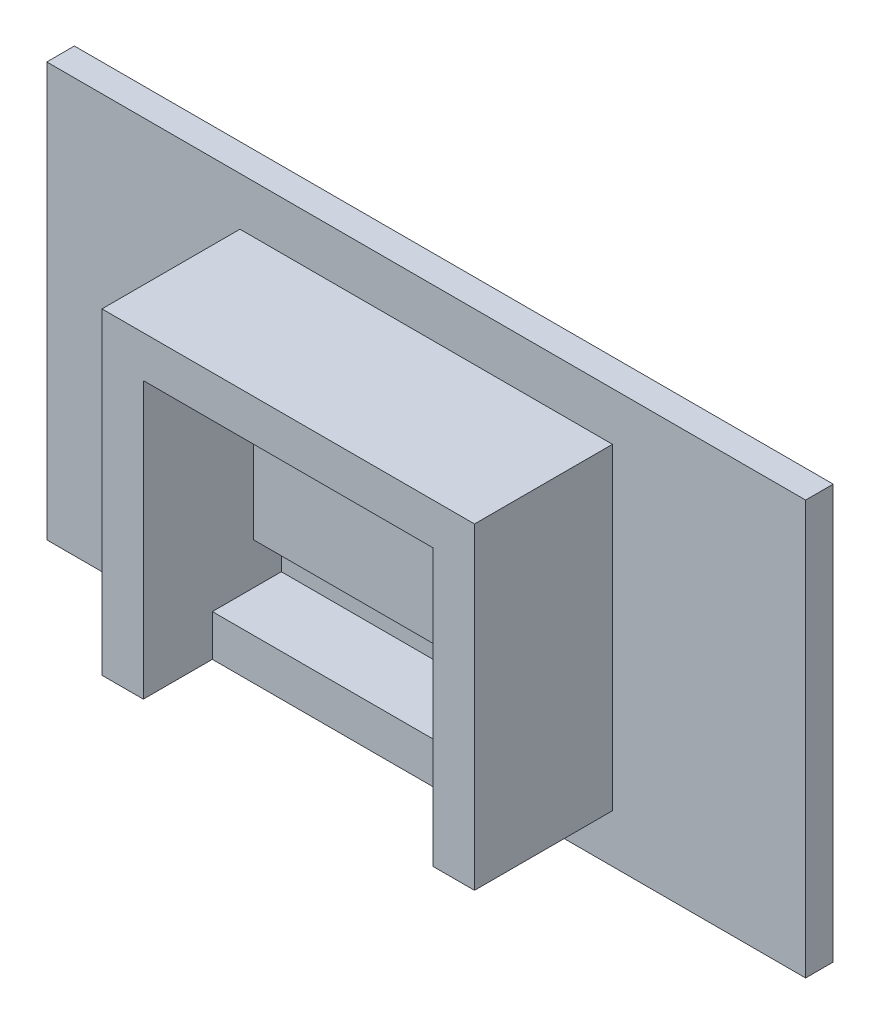
ISO-10303-21;
HEADER;
FILE_DESCRIPTION(('STEP AP214'),'2;1');
FILE_NAME('part.step','',(''),(''),'','','');
FILE_SCHEMA(('AUTOMOTIVE_DESIGN { 1 0 10303 214 1 1 1 1 }'));
ENDSEC;
DATA;
#1=APPLICATION_CONTEXT('core data for automotive mechanical design processes');
#2=APPLICATION_PROTOCOL_DEFINITION('international standard','automotive_design',2000,#1);
#3=PRODUCT_CONTEXT('',#1,'mechanical');
#4=PRODUCT('Part','Part','',(#3));
#5=PRODUCT_RELATED_PRODUCT_CATEGORY('part','',(#4));
#6=PRODUCT_DEFINITION_FORMATION('','',#4);
#7=PRODUCT_DEFINITION_CONTEXT('part definition',#1,'design');
#8=PRODUCT_DEFINITION('design','',#6,#7);
#9=PRODUCT_DEFINITION_SHAPE('','',#8);
#10=(LENGTH_UNIT() NAMED_UNIT(*) SI_UNIT(.MILLI.,.METRE.));
#11=(NAMED_UNIT(*) PLANE_ANGLE_UNIT() SI_UNIT($,.RADIAN.));
#12=(NAMED_UNIT(*) SI_UNIT($,.STERADIAN.) SOLID_ANGLE_UNIT());
#13=UNCERTAINTY_MEASURE_WITH_UNIT(LENGTH_MEASURE(1.E-05),#10,'distance_accuracy_value','');
#14=(GEOMETRIC_REPRESENTATION_CONTEXT(3) GLOBAL_UNCERTAINTY_ASSIGNED_CONTEXT((#13)) GLOBAL_UNIT_ASSIGNED_CONTEXT((#10,
#11,#12)) REPRESENTATION_CONTEXT('',''));
#15=CARTESIAN_POINT('',(0.,0.,0.));
#16=DIRECTION('',(0.,0.,1.));
#17=DIRECTION('',(1.,0.,0.));
#18=AXIS2_PLACEMENT_3D('',#15,#16,#17);
#19=CARTESIAN_POINT('',(-10.5,8.5,12.));
#20=DIRECTION('',(1.,0.,0.));
#21=DIRECTION('',(0.,1.,0.));
#22=AXIS2_PLACEMENT_3D('',#19,#20,#21);
#23=PLANE('',#22);
#24=DIRECTION('',(0.,-1.,0.));
#25=VECTOR('',#24,1.);
#26=CARTESIAN_POINT('',(-10.5,8.5,2.));
#27=LINE('',#26,#25);
#28=CARTESIAN_POINT('',(-10.5,-5.5,2.));
#29=VERTEX_POINT('',#28);
#30=CARTESIAN_POINT('',(-10.5,-8.5,2.));
#31=VERTEX_POINT('',#30);
#32=EDGE_CURVE('E554',#29,#31,#27,.T.);
#33=ORIENTED_EDGE('',*,*,#32,.F.);
#34=DIRECTION('',(0.,0.,-1.));
#35=VECTOR('',#34,1.);
#36=CARTESIAN_POINT('',(-10.5,-5.5,4.));
#37=LINE('',#36,#35);
#38=CARTESIAN_POINT('',(-10.5,-5.5,4.));
#39=VERTEX_POINT('',#38);
#40=EDGE_CURVE('E63',#39,#29,#37,.T.);
#41=ORIENTED_EDGE('',*,*,#40,.F.);
#42=DIRECTION('',(0.,-1.,0.));
#43=VECTOR('',#42,1.);
#44=CARTESIAN_POINT('',(-10.5,8.5,4.));
#45=LINE('',#44,#43);
#46=CARTESIAN_POINT('',(-10.5,8.5,4.));
#47=VERTEX_POINT('',#46);
#48=EDGE_CURVE('E529',#47,#39,#45,.T.);
#49=ORIENTED_EDGE('',*,*,#48,.F.);
#50=DIRECTION('',(0.,0.,-1.));
#51=VECTOR('',#50,1.);
#52=CARTESIAN_POINT('',(-10.5,8.5,12.));
#53=LINE('',#52,#51);
#54=CARTESIAN_POINT('',(-10.5,8.5,12.));
#55=VERTEX_POINT('',#54);
#56=EDGE_CURVE('E566',#55,#47,#53,.T.);
#57=ORIENTED_EDGE('',*,*,#56,.F.);
#58=DIRECTION('',(0.,-1.,0.));
#59=VECTOR('',#58,1.);
#60=CARTESIAN_POINT('',(-10.5,8.5,12.));
#61=LINE('',#60,#59);
#62=CARTESIAN_POINT('',(-10.5,-11.5,12.));
#63=VERTEX_POINT('',#62);
#64=EDGE_CURVE('E555',#55,#63,#61,.T.);
#65=ORIENTED_EDGE('',*,*,#64,.T.);
#66=DIRECTION('',(0.,0.,-1.));
#67=VECTOR('',#66,1.);
#68=CARTESIAN_POINT('',(-10.5,-11.5,12.));
#69=LINE('',#68,#67);
#70=CARTESIAN_POINT('',(-10.5,-11.5,7.));
#71=VERTEX_POINT('',#70);
#72=EDGE_CURVE('E158',#63,#71,#69,.T.);
#73=ORIENTED_EDGE('',*,*,#72,.T.);
#74=DIRECTION('',(0.,-1.,0.));
#75=VECTOR('',#74,1.);
#76=CARTESIAN_POINT('',(-10.5,-8.5,7.));
#77=LINE('',#76,#75);
#78=CARTESIAN_POINT('',(-10.5,-8.5,7.));
#79=VERTEX_POINT('',#78);
#80=EDGE_CURVE('E153',#79,#71,#77,.T.);
#81=ORIENTED_EDGE('',*,*,#80,.F.);
#82=DIRECTION('',(0.,0.,-1.));
#83=VECTOR('',#82,1.);
#84=CARTESIAN_POINT('',(-10.5,-8.5,12.));
#85=LINE('',#84,#83);
#86=EDGE_CURVE('E155',#79,#31,#85,.T.);
#87=ORIENTED_EDGE('',*,*,#86,.T.);
#88=EDGE_LOOP('',(#33,#41,#49,#57,#65,#73,#81,#87));
#89=FACE_BOUND('',#88,.T.);
#90=ADVANCED_FACE('F39',(#89),#23,.T.);
#91=CARTESIAN_POINT('',(10.5,8.5,12.));
#92=DIRECTION('',(-1.,0.,0.));
#93=DIRECTION('',(0.,-1.,0.));
#94=AXIS2_PLACEMENT_3D('',#91,#92,#93);
#95=PLANE('',#94);
#96=DIRECTION('',(0.,1.,0.));
#97=VECTOR('',#96,1.);
#98=CARTESIAN_POINT('',(10.5,8.5,4.));
#99=LINE('',#98,#97);
#100=CARTESIAN_POINT('',(10.5,-5.5,4.));
#101=VERTEX_POINT('',#100);
#102=CARTESIAN_POINT('',(10.5,8.5,4.));
#103=VERTEX_POINT('',#102);
#104=EDGE_CURVE('E537',#101,#103,#99,.T.);
#105=ORIENTED_EDGE('',*,*,#104,.F.);
#106=DIRECTION('',(0.,0.,-1.));
#107=VECTOR('',#106,1.);
#108=CARTESIAN_POINT('',(10.5,-5.5,4.));
#109=LINE('',#108,#107);
#110=CARTESIAN_POINT('',(10.5,-5.5,2.));
#111=VERTEX_POINT('',#110);
#112=EDGE_CURVE('E545',#101,#111,#109,.T.);
#113=ORIENTED_EDGE('',*,*,#112,.T.);
#114=DIRECTION('',(0.,1.,0.));
#115=VECTOR('',#114,1.);
#116=CARTESIAN_POINT('',(10.5,8.5,2.));
#117=LINE('',#116,#115);
#118=CARTESIAN_POINT('',(10.5,-8.5,2.));
#119=VERTEX_POINT('',#118);
#120=EDGE_CURVE('E559',#119,#111,#117,.T.);
#121=ORIENTED_EDGE('',*,*,#120,.F.);
#122=DIRECTION('',(0.,0.,-1.));
#123=VECTOR('',#122,1.);
#124=CARTESIAN_POINT('',(10.5,-8.5,12.));
#125=LINE('',#124,#123);
#126=CARTESIAN_POINT('',(10.5,-8.5,7.));
#127=VERTEX_POINT('',#126);
#128=EDGE_CURVE('E175',#127,#119,#125,.T.);
#129=ORIENTED_EDGE('',*,*,#128,.F.);
#130=DIRECTION('',(0.,-1.,0.));
#131=VECTOR('',#130,1.);
#132=CARTESIAN_POINT('',(10.5,-8.5,7.));
#133=LINE('',#132,#131);
#134=CARTESIAN_POINT('',(10.5,-11.5,7.));
#135=VERTEX_POINT('',#134);
#136=EDGE_CURVE('E55',#127,#135,#133,.T.);
#137=ORIENTED_EDGE('',*,*,#136,.T.);
#138=DIRECTION('',(0.,0.,1.));
#139=VECTOR('',#138,1.);
#140=CARTESIAN_POINT('',(10.5,-11.5,12.));
#141=LINE('',#140,#139);
#142=CARTESIAN_POINT('',(10.5,-11.5,12.));
#143=VERTEX_POINT('',#142);
#144=EDGE_CURVE('E167',#135,#143,#141,.T.);
#145=ORIENTED_EDGE('',*,*,#144,.T.);
#146=DIRECTION('',(0.,1.,0.));
#147=VECTOR('',#146,1.);
#148=CARTESIAN_POINT('',(10.5,8.5,12.));
#149=LINE('',#148,#147);
#150=CARTESIAN_POINT('',(10.5,8.5,12.));
#151=VERTEX_POINT('',#150);
#152=EDGE_CURVE('E558',#143,#151,#149,.T.);
#153=ORIENTED_EDGE('',*,*,#152,.T.);
#154=DIRECTION('',(0.,0.,-1.));
#155=VECTOR('',#154,1.);
#156=CARTESIAN_POINT('',(10.5,8.5,12.));
#157=LINE('',#156,#155);
#158=EDGE_CURVE('E182',#151,#103,#157,.T.);
#159=ORIENTED_EDGE('',*,*,#158,.T.);
#160=EDGE_LOOP('',(#105,#113,#121,#129,#137,#145,#153,#159));
#161=FACE_BOUND('',#160,.T.);
#162=ADVANCED_FACE('F292',(#161),#95,.T.);
#163=CARTESIAN_POINT('',(0.,0.,2.));
#164=DIRECTION('',(0.,0.,-1.));
#165=DIRECTION('',(-1.,0.,0.));
#166=AXIS2_PLACEMENT_3D('',#163,#164,#165);
#167=PLANE('',#166);
#168=DIRECTION('',(1.,0.,0.));
#169=VECTOR('',#168,1.);
#170=CARTESIAN_POINT('',(-10.5,-5.5,2.));
#171=LINE('',#170,#169);
#172=EDGE_CURVE('E527',#29,#111,#171,.T.);
#173=ORIENTED_EDGE('',*,*,#172,.F.);
#174=ORIENTED_EDGE('',*,*,#32,.T.);
#175=DIRECTION('',(1.,0.,0.));
#176=VECTOR('',#175,1.);
#177=CARTESIAN_POINT('',(-10.5,-8.5,2.));
#178=LINE('',#177,#176);
#179=EDGE_CURVE('E172',#31,#119,#178,.T.);
#180=ORIENTED_EDGE('',*,*,#179,.T.);
#181=ORIENTED_EDGE('',*,*,#120,.T.);
#182=EDGE_LOOP('',(#173,#174,#180,#181));
#183=FACE_BOUND('',#182,.T.);
#184=ADVANCED_FACE('F297',(#183),#167,.F.);
#185=DIRECTION('',(0.,1.,0.));
#186=VECTOR('',#185,1.);
#187=CARTESIAN_POINT('',(27.5,-15.,2.));
#188=LINE('',#187,#186);
#189=CARTESIAN_POINT('',(27.5,-15.,2.));
#190=VERTEX_POINT('',#189);
#191=CARTESIAN_POINT('',(27.5,15.,2.));
#192=VERTEX_POINT('',#191);
#193=EDGE_CURVE('E229',#190,#192,#188,.T.);
#194=ORIENTED_EDGE('',*,*,#193,.T.);
#195=DIRECTION('',(-1.,0.,0.));
#196=VECTOR('',#195,1.);
#197=CARTESIAN_POINT('',(-27.5,15.,2.));
#198=LINE('',#197,#196);
#199=CARTESIAN_POINT('',(-27.5,15.,2.));
#200=VERTEX_POINT('',#199);
#201=EDGE_CURVE('E233',#192,#200,#198,.T.);
#202=ORIENTED_EDGE('',*,*,#201,.T.);
#203=DIRECTION('',(0.,-1.,0.));
#204=VECTOR('',#203,1.);
#205=CARTESIAN_POINT('',(-27.5,-15.,2.));
#206=LINE('',#205,#204);
#207=CARTESIAN_POINT('',(-27.5,-15.,2.));
#208=VERTEX_POINT('',#207);
#209=EDGE_CURVE('E237',#200,#208,#206,.T.);
#210=ORIENTED_EDGE('',*,*,#209,.T.);
#211=DIRECTION('',(1.,0.,0.));
#212=VECTOR('',#211,1.);
#213=CARTESIAN_POINT('',(-27.5,-15.,2.));
#214=LINE('',#213,#212);
#215=EDGE_CURVE('E240',#208,#190,#214,.T.);
#216=ORIENTED_EDGE('',*,*,#215,.T.);
#217=EDGE_LOOP('',(#194,#202,#210,#216));
#218=FACE_BOUND('',#217,.T.);
#219=DIRECTION('',(0.,1.,0.));
#220=VECTOR('',#219,1.);
#221=CARTESIAN_POINT('',(13.5,-11.5,2.));
#222=LINE('',#221,#220);
#223=CARTESIAN_POINT('',(13.5,-11.5,2.));
#224=VERTEX_POINT('',#223);
#225=CARTESIAN_POINT('',(13.5,11.5,2.));
#226=VERTEX_POINT('',#225);
#227=EDGE_CURVE('E174',#224,#226,#222,.T.);
#228=ORIENTED_EDGE('',*,*,#227,.F.);
#229=DIRECTION('',(1.,0.,0.));
#230=VECTOR('',#229,1.);
#231=CARTESIAN_POINT('',(-13.5,-11.5,2.));
#232=LINE('',#231,#230);
#233=CARTESIAN_POINT('',(-13.5,-11.5,2.));
#234=VERTEX_POINT('',#233);
#235=EDGE_CURVE('E191',#234,#224,#232,.T.);
#236=ORIENTED_EDGE('',*,*,#235,.F.);
#237=DIRECTION('',(0.,-1.,0.));
#238=VECTOR('',#237,1.);
#239=CARTESIAN_POINT('',(-13.5,-11.5,2.));
#240=LINE('',#239,#238);
#241=CARTESIAN_POINT('',(-13.5,11.5,2.));
#242=VERTEX_POINT('',#241);
#243=EDGE_CURVE('E206',#242,#234,#240,.T.);
#244=ORIENTED_EDGE('',*,*,#243,.F.);
#245=DIRECTION('',(-1.,0.,0.));
#246=VECTOR('',#245,1.);
#247=CARTESIAN_POINT('',(-13.5,11.5,2.));
#248=LINE('',#247,#246);
#249=EDGE_CURVE('E180',#226,#242,#248,.T.);
#250=ORIENTED_EDGE('',*,*,#249,.F.);
#251=EDGE_LOOP('',(#228,#236,#244,#250));
#252=FACE_BOUND('',#251,.T.);
#253=ADVANCED_FACE('F282',(#218,#252),#167,.F.);
#254=CARTESIAN_POINT('',(27.5,-15.,2.));
#255=DIRECTION('',(-1.,0.,0.));
#256=DIRECTION('',(0.,0.,1.));
#257=AXIS2_PLACEMENT_3D('',#254,#255,#256);
#258=PLANE('',#257);
#259=DIRECTION('',(0.,1.,0.));
#260=VECTOR('',#259,1.);
#261=CARTESIAN_POINT('',(27.5,-15.,0.));
#262=LINE('',#261,#260);
#263=CARTESIAN_POINT('',(27.5,-15.,0.));
#264=VERTEX_POINT('',#263);
#265=CARTESIAN_POINT('',(27.5,15.,0.));
#266=VERTEX_POINT('',#265);
#267=EDGE_CURVE('E228',#264,#266,#262,.T.);
#268=ORIENTED_EDGE('',*,*,#267,.T.);
#269=DIRECTION('',(0.,0.,-1.));
#270=VECTOR('',#269,1.);
#271=CARTESIAN_POINT('',(27.5,15.,2.));
#272=LINE('',#271,#270);
#273=EDGE_CURVE('E11',#192,#266,#272,.T.);
#274=ORIENTED_EDGE('',*,*,#273,.F.);
#275=ORIENTED_EDGE('',*,*,#193,.F.);
#276=DIRECTION('',(0.,0.,-1.));
#277=VECTOR('',#276,1.);
#278=CARTESIAN_POINT('',(27.5,-15.,2.));
#279=LINE('',#278,#277);
#280=EDGE_CURVE('E243',#190,#264,#279,.T.);
#281=ORIENTED_EDGE('',*,*,#280,.T.);
#282=EDGE_LOOP('',(#268,#274,#275,#281));
#283=FACE_BOUND('',#282,.T.);
#284=ADVANCED_FACE('F41',(#283),#258,.F.);
#285=CARTESIAN_POINT('',(-27.5,15.,2.));
#286=DIRECTION('',(0.,-1.,0.));
#287=DIRECTION('',(0.,0.,-1.));
#288=AXIS2_PLACEMENT_3D('',#285,#286,#287);
#289=PLANE('',#288);
#290=DIRECTION('',(-1.,0.,0.));
#291=VECTOR('',#290,1.);
#292=CARTESIAN_POINT('',(-27.5,15.,0.));
#293=LINE('',#292,#291);
#294=CARTESIAN_POINT('',(-27.5,15.,0.));
#295=VERTEX_POINT('',#294);
#296=EDGE_CURVE('E247',#266,#295,#293,.T.);
#297=ORIENTED_EDGE('',*,*,#296,.T.);
#298=DIRECTION('',(0.,0.,-1.));
#299=VECTOR('',#298,1.);
#300=CARTESIAN_POINT('',(-27.5,15.,2.));
#301=LINE('',#300,#299);
#302=EDGE_CURVE('E48',#200,#295,#301,.T.);
#303=ORIENTED_EDGE('',*,*,#302,.F.);
#304=ORIENTED_EDGE('',*,*,#201,.F.);
#305=ORIENTED_EDGE('',*,*,#273,.T.);
#306=EDGE_LOOP('',(#297,#303,#304,#305));
#307=FACE_BOUND('',#306,.T.);
#308=ADVANCED_FACE('F284',(#307),#289,.F.);
#309=CARTESIAN_POINT('',(-27.5,-15.,2.));
#310=DIRECTION('',(1.,0.,0.));
#311=DIRECTION('',(0.,0.,-1.));
#312=AXIS2_PLACEMENT_3D('',#309,#310,#311);
#313=PLANE('',#312);
#314=DIRECTION('',(0.,-1.,0.));
#315=VECTOR('',#314,1.);
#316=CARTESIAN_POINT('',(-27.5,-15.,0.));
#317=LINE('',#316,#315);
#318=CARTESIAN_POINT('',(-27.5,-15.,0.));
#319=VERTEX_POINT('',#318);
#320=EDGE_CURVE('E250',#295,#319,#317,.T.);
#321=ORIENTED_EDGE('',*,*,#320,.T.);
#322=DIRECTION('',(0.,0.,-1.));
#323=VECTOR('',#322,1.);
#324=CARTESIAN_POINT('',(-27.5,-15.,2.));
#325=LINE('',#324,#323);
#326=EDGE_CURVE('E258',#208,#319,#325,.T.);
#327=ORIENTED_EDGE('',*,*,#326,.F.);
#328=ORIENTED_EDGE('',*,*,#209,.F.);
#329=ORIENTED_EDGE('',*,*,#302,.T.);
#330=EDGE_LOOP('',(#321,#327,#328,#329));
#331=FACE_BOUND('',#330,.T.);
#332=ADVANCED_FACE('F267',(#331),#313,.F.);
#333=CARTESIAN_POINT('',(-27.5,-15.,2.));
#334=DIRECTION('',(0.,1.,0.));
#335=DIRECTION('',(0.,0.,1.));
#336=AXIS2_PLACEMENT_3D('',#333,#334,#335);
#337=PLANE('',#336);
#338=DIRECTION('',(1.,0.,0.));
#339=VECTOR('',#338,1.);
#340=CARTESIAN_POINT('',(-27.5,-15.,0.));
#341=LINE('',#340,#339);
#342=EDGE_CURVE('E234',#319,#264,#341,.T.);
#343=ORIENTED_EDGE('',*,*,#342,.T.);
#344=ORIENTED_EDGE('',*,*,#280,.F.);
#345=ORIENTED_EDGE('',*,*,#215,.F.);
#346=ORIENTED_EDGE('',*,*,#326,.T.);
#347=EDGE_LOOP('',(#343,#344,#345,#346));
#348=FACE_BOUND('',#347,.T.);
#349=ADVANCED_FACE('F276',(#348),#337,.F.);
#350=CARTESIAN_POINT('',(0.,0.,0.));
#351=DIRECTION('',(0.,0.,-1.));
#352=DIRECTION('',(-1.,0.,0.));
#353=AXIS2_PLACEMENT_3D('',#350,#351,#352);
#354=PLANE('',#353);
#355=ORIENTED_EDGE('',*,*,#267,.F.);
#356=ORIENTED_EDGE('',*,*,#342,.F.);
#357=ORIENTED_EDGE('',*,*,#320,.F.);
#358=ORIENTED_EDGE('',*,*,#296,.F.);
#359=EDGE_LOOP('',(#355,#356,#357,#358));
#360=FACE_BOUND('',#359,.T.);
#361=ADVANCED_FACE('F273',(#360),#354,.T.);
#362=CARTESIAN_POINT('',(0.,0.,12.));
#363=DIRECTION('',(0.,0.,-1.));
#364=DIRECTION('',(-1.,0.,0.));
#365=AXIS2_PLACEMENT_3D('',#362,#363,#364);
#366=PLANE('',#365);
#367=DIRECTION('',(1.,0.,0.));
#368=VECTOR('',#367,1.);
#369=CARTESIAN_POINT('',(-13.5,-11.5,12.));
#370=LINE('',#369,#368);
#371=CARTESIAN_POINT('',(-13.5,-11.5,12.));
#372=VERTEX_POINT('',#371);
#373=EDGE_CURVE('E198',#372,#63,#370,.T.);
#374=ORIENTED_EDGE('',*,*,#373,.T.);
#375=ORIENTED_EDGE('',*,*,#64,.F.);
#376=DIRECTION('',(-1.,0.,0.));
#377=VECTOR('',#376,1.);
#378=CARTESIAN_POINT('',(-10.5,8.5,12.));
#379=LINE('',#378,#377);
#380=EDGE_CURVE('E563',#151,#55,#379,.T.);
#381=ORIENTED_EDGE('',*,*,#380,.F.);
#382=ORIENTED_EDGE('',*,*,#152,.F.);
#383=CARTESIAN_POINT('',(13.5,-11.5,12.));
#384=VERTEX_POINT('',#383);
#385=EDGE_CURVE('E197',#143,#384,#370,.T.);
#386=ORIENTED_EDGE('',*,*,#385,.T.);
#387=DIRECTION('',(0.,1.,0.));
#388=VECTOR('',#387,1.);
#389=CARTESIAN_POINT('',(13.5,-11.5,12.));
#390=LINE('',#389,#388);
#391=CARTESIAN_POINT('',(13.5,11.5,12.));
#392=VERTEX_POINT('',#391);
#393=EDGE_CURVE('E186',#384,#392,#390,.T.);
#394=ORIENTED_EDGE('',*,*,#393,.T.);
#395=DIRECTION('',(-1.,0.,0.));
#396=VECTOR('',#395,1.);
#397=CARTESIAN_POINT('',(-13.5,11.5,12.));
#398=LINE('',#397,#396);
#399=CARTESIAN_POINT('',(-13.5,11.5,12.));
#400=VERTEX_POINT('',#399);
#401=EDGE_CURVE('E190',#392,#400,#398,.T.);
#402=ORIENTED_EDGE('',*,*,#401,.T.);
#403=DIRECTION('',(0.,-1.,0.));
#404=VECTOR('',#403,1.);
#405=CARTESIAN_POINT('',(-13.5,-11.5,12.));
#406=LINE('',#405,#404);
#407=EDGE_CURVE('E194',#400,#372,#406,.T.);
#408=ORIENTED_EDGE('',*,*,#407,.T.);
#409=EDGE_LOOP('',(#374,#375,#381,#382,#386,#394,#402,#408));
#410=FACE_BOUND('',#409,.T.);
#411=ADVANCED_FACE('F302',(#410),#366,.F.);
#412=CARTESIAN_POINT('',(13.5,-11.5,12.));
#413=DIRECTION('',(-1.,0.,0.));
#414=DIRECTION('',(0.,0.,1.));
#415=AXIS2_PLACEMENT_3D('',#412,#413,#414);
#416=PLANE('',#415);
#417=ORIENTED_EDGE('',*,*,#227,.T.);
#418=DIRECTION('',(0.,0.,-1.));
#419=VECTOR('',#418,1.);
#420=CARTESIAN_POINT('',(13.5,11.5,12.));
#421=LINE('',#420,#419);
#422=EDGE_CURVE('E224',#392,#226,#421,.T.);
#423=ORIENTED_EDGE('',*,*,#422,.F.);
#424=ORIENTED_EDGE('',*,*,#393,.F.);
#425=DIRECTION('',(0.,0.,-1.));
#426=VECTOR('',#425,1.);
#427=CARTESIAN_POINT('',(13.5,-11.5,12.));
#428=LINE('',#427,#426);
#429=EDGE_CURVE('E201',#384,#224,#428,.T.);
#430=ORIENTED_EDGE('',*,*,#429,.T.);
#431=EDGE_LOOP('',(#417,#423,#424,#430));
#432=FACE_BOUND('',#431,.T.);
#433=ADVANCED_FACE('F305',(#432),#416,.F.);
#434=CARTESIAN_POINT('',(-13.5,11.5,12.));
#435=DIRECTION('',(0.,-1.,0.));
#436=DIRECTION('',(0.,0.,-1.));
#437=AXIS2_PLACEMENT_3D('',#434,#435,#436);
#438=PLANE('',#437);
#439=ORIENTED_EDGE('',*,*,#249,.T.);
#440=DIRECTION('',(0.,0.,-1.));
#441=VECTOR('',#440,1.);
#442=CARTESIAN_POINT('',(-13.5,11.5,12.));
#443=LINE('',#442,#441);
#444=EDGE_CURVE('E220',#400,#242,#443,.T.);
#445=ORIENTED_EDGE('',*,*,#444,.F.);
#446=ORIENTED_EDGE('',*,*,#401,.F.);
#447=ORIENTED_EDGE('',*,*,#422,.T.);
#448=EDGE_LOOP('',(#439,#445,#446,#447));
#449=FACE_BOUND('',#448,.T.);
#450=ADVANCED_FACE('F314',(#449),#438,.F.);
#451=CARTESIAN_POINT('',(-13.5,-11.5,12.));
#452=DIRECTION('',(1.,0.,0.));
#453=DIRECTION('',(0.,0.,-1.));
#454=AXIS2_PLACEMENT_3D('',#451,#452,#453);
#455=PLANE('',#454);
#456=ORIENTED_EDGE('',*,*,#243,.T.);
#457=DIRECTION('',(0.,0.,-1.));
#458=VECTOR('',#457,1.);
#459=CARTESIAN_POINT('',(-13.5,-11.5,12.));
#460=LINE('',#459,#458);
#461=EDGE_CURVE('E216',#372,#234,#460,.T.);
#462=ORIENTED_EDGE('',*,*,#461,.F.);
#463=ORIENTED_EDGE('',*,*,#407,.F.);
#464=ORIENTED_EDGE('',*,*,#444,.T.);
#465=EDGE_LOOP('',(#456,#462,#463,#464));
#466=FACE_BOUND('',#465,.T.);
#467=ADVANCED_FACE('F310',(#466),#455,.F.);
#468=CARTESIAN_POINT('',(-13.5,-11.5,12.));
#469=DIRECTION('',(0.,1.,0.));
#470=DIRECTION('',(0.,0.,1.));
#471=AXIS2_PLACEMENT_3D('',#468,#469,#470);
#472=PLANE('',#471);
#473=DIRECTION('',(1.,0.,0.));
#474=VECTOR('',#473,1.);
#475=CARTESIAN_POINT('',(-10.5,-11.5,7.));
#476=LINE('',#475,#474);
#477=EDGE_CURVE('E520',#71,#135,#476,.T.);
#478=ORIENTED_EDGE('',*,*,#477,.F.);
#479=ORIENTED_EDGE('',*,*,#72,.F.);
#480=ORIENTED_EDGE('',*,*,#373,.F.);
#481=ORIENTED_EDGE('',*,*,#461,.T.);
#482=ORIENTED_EDGE('',*,*,#235,.T.);
#483=ORIENTED_EDGE('',*,*,#429,.F.);
#484=ORIENTED_EDGE('',*,*,#385,.F.);
#485=ORIENTED_EDGE('',*,*,#144,.F.);
#486=EDGE_LOOP('',(#478,#479,#480,#481,#482,#483,#484,#485));
#487=FACE_BOUND('',#486,.T.);
#488=ADVANCED_FACE('F307',(#487),#472,.F.);
#489=CARTESIAN_POINT('',(-10.5,-8.5,12.));
#490=DIRECTION('',(0.,1.,0.));
#491=DIRECTION('',(0.,0.,1.));
#492=AXIS2_PLACEMENT_3D('',#489,#490,#491);
#493=PLANE('',#492);
#494=DIRECTION('',(1.,0.,0.));
#495=VECTOR('',#494,1.);
#496=CARTESIAN_POINT('',(-10.5,-8.5,7.));
#497=LINE('',#496,#495);
#498=EDGE_CURVE('E161',#79,#127,#497,.T.);
#499=ORIENTED_EDGE('',*,*,#498,.T.);
#500=ORIENTED_EDGE('',*,*,#128,.T.);
#501=ORIENTED_EDGE('',*,*,#179,.F.);
#502=ORIENTED_EDGE('',*,*,#86,.F.);
#503=EDGE_LOOP('',(#499,#500,#501,#502));
#504=FACE_BOUND('',#503,.T.);
#505=ADVANCED_FACE('F170',(#504),#493,.T.);
#506=CARTESIAN_POINT('',(-10.5,8.5,12.));
#507=DIRECTION('',(0.,-1.,0.));
#508=DIRECTION('',(0.,0.,-1.));
#509=AXIS2_PLACEMENT_3D('',#506,#507,#508);
#510=PLANE('',#509);
#511=DIRECTION('',(-1.,0.,0.));
#512=VECTOR('',#511,1.);
#513=CARTESIAN_POINT('',(-10.5,8.5,4.));
#514=LINE('',#513,#512);
#515=EDGE_CURVE('E541',#103,#47,#514,.T.);
#516=ORIENTED_EDGE('',*,*,#515,.F.);
#517=ORIENTED_EDGE('',*,*,#158,.F.);
#518=ORIENTED_EDGE('',*,*,#380,.T.);
#519=ORIENTED_EDGE('',*,*,#56,.T.);
#520=EDGE_LOOP('',(#516,#517,#518,#519));
#521=FACE_BOUND('',#520,.T.);
#522=ADVANCED_FACE('F365',(#521),#510,.T.);
#523=CARTESIAN_POINT('',(-10.5,-5.5,4.));
#524=DIRECTION('',(0.,1.,0.));
#525=DIRECTION('',(0.,0.,1.));
#526=AXIS2_PLACEMENT_3D('',#523,#524,#525);
#527=PLANE('',#526);
#528=ORIENTED_EDGE('',*,*,#172,.T.);
#529=ORIENTED_EDGE('',*,*,#112,.F.);
#530=DIRECTION('',(1.,0.,0.));
#531=VECTOR('',#530,1.);
#532=CARTESIAN_POINT('',(-10.5,-5.5,4.));
#533=LINE('',#532,#531);
#534=EDGE_CURVE('E533',#39,#101,#533,.T.);
#535=ORIENTED_EDGE('',*,*,#534,.F.);
#536=ORIENTED_EDGE('',*,*,#40,.T.);
#537=EDGE_LOOP('',(#528,#529,#535,#536));
#538=FACE_BOUND('',#537,.T.);
#539=ADVANCED_FACE('F372',(#538),#527,.F.);
#540=CARTESIAN_POINT('',(0.,0.,4.));
#541=DIRECTION('',(0.,0.,1.));
#542=DIRECTION('',(1.,0.,0.));
#543=AXIS2_PLACEMENT_3D('',#540,#541,#542);
#544=PLANE('',#543);
#545=CARTESIAN_POINT('',(8.,6.,4.));
#546=DIRECTION('',(0.,0.,1.));
#547=DIRECTION('',(1.,0.,0.));
#548=AXIS2_PLACEMENT_3D('',#545,#546,#547);
#549=CIRCLE('',#548,1.5);
#550=CARTESIAN_POINT('',(9.5,6.,4.));
#551=VERTEX_POINT('',#550);
#552=EDGE_CURVE('E505',#551,#551,#549,.T.);
#553=ORIENTED_EDGE('',*,*,#552,.F.);
#554=EDGE_LOOP('',(#553));
#555=FACE_BOUND('',#554,.T.);
#556=CARTESIAN_POINT('',(-8.,6.,4.));
#557=DIRECTION('',(0.,0.,1.));
#558=DIRECTION('',(1.,0.,0.));
#559=AXIS2_PLACEMENT_3D('',#556,#557,#558);
#560=CIRCLE('',#559,1.5);
#561=CARTESIAN_POINT('',(-6.5,6.,4.));
#562=VERTEX_POINT('',#561);
#563=EDGE_CURVE('E504',#562,#562,#560,.T.);
#564=ORIENTED_EDGE('',*,*,#563,.F.);
#565=EDGE_LOOP('',(#564));
#566=FACE_BOUND('',#565,.T.);
#567=ORIENTED_EDGE('',*,*,#48,.T.);
#568=ORIENTED_EDGE('',*,*,#534,.T.);
#569=ORIENTED_EDGE('',*,*,#104,.T.);
#570=ORIENTED_EDGE('',*,*,#515,.T.);
#571=EDGE_LOOP('',(#567,#568,#569,#570));
#572=FACE_BOUND('',#571,.T.);
#573=ADVANCED_FACE('F380',(#555,#566,#572),#544,.T.);
#574=CARTESIAN_POINT('',(-10.5,-8.5,7.));
#575=DIRECTION('',(0.,0.,-1.));
#576=DIRECTION('',(-1.,0.,0.));
#577=AXIS2_PLACEMENT_3D('',#574,#575,#576);
#578=PLANE('',#577);
#579=ORIENTED_EDGE('',*,*,#477,.T.);
#580=ORIENTED_EDGE('',*,*,#136,.F.);
#581=ORIENTED_EDGE('',*,*,#498,.F.);
#582=ORIENTED_EDGE('',*,*,#80,.T.);
#583=EDGE_LOOP('',(#579,#580,#581,#582));
#584=FACE_BOUND('',#583,.T.);
#585=ADVANCED_FACE('F163',(#584),#578,.F.);
#586=CARTESIAN_POINT('',(-8.,6.,7.));
#587=DIRECTION('',(0.,0.,-1.));
#588=DIRECTION('',(-1.,0.,0.));
#589=AXIS2_PLACEMENT_3D('',#586,#587,#588);
#590=CYLINDRICAL_SURFACE('',#589,1.5);
#591=CARTESIAN_POINT('',(-8.,6.,7.));
#592=DIRECTION('',(0.,0.,1.));
#593=DIRECTION('',(1.,0.,0.));
#594=AXIS2_PLACEMENT_3D('',#591,#592,#593);
#595=CIRCLE('',#594,1.5);
#596=CARTESIAN_POINT('',(-6.5,6.,7.));
#597=VERTEX_POINT('',#596);
#598=EDGE_CURVE('E510',#597,#597,#595,.T.);
#599=ORIENTED_EDGE('',*,*,#598,.F.);
#600=EDGE_LOOP('',(#599));
#601=FACE_BOUND('',#600,.T.);
#602=ORIENTED_EDGE('',*,*,#563,.T.);
#603=EDGE_LOOP('',(#602));
#604=FACE_BOUND('',#603,.T.);
#605=ADVANCED_FACE('F395',(#601,#604),#590,.T.);
#606=CARTESIAN_POINT('',(-8.,6.,7.));
#607=DIRECTION('',(0.,0.,1.));
#608=DIRECTION('',(1.,0.,0.));
#609=AXIS2_PLACEMENT_3D('',#606,#607,#608);
#610=PLANE('',#609);
#611=ORIENTED_EDGE('',*,*,#598,.T.);
#612=EDGE_LOOP('',(#611));
#613=FACE_BOUND('',#612,.T.);
#614=ADVANCED_FACE('F401',(#613),#610,.T.);
#615=CARTESIAN_POINT('',(8.,6.,7.));
#616=DIRECTION('',(0.,0.,-1.));
#617=DIRECTION('',(-1.,0.,0.));
#618=AXIS2_PLACEMENT_3D('',#615,#616,#617);
#619=CYLINDRICAL_SURFACE('',#618,1.5);
#620=CARTESIAN_POINT('',(8.,6.,7.));
#621=DIRECTION('',(0.,0.,1.));
#622=DIRECTION('',(1.,0.,0.));
#623=AXIS2_PLACEMENT_3D('',#620,#621,#622);
#624=CIRCLE('',#623,1.5);
#625=CARTESIAN_POINT('',(9.5,6.,7.));
#626=VERTEX_POINT('',#625);
#627=EDGE_CURVE('E502',#626,#626,#624,.T.);
#628=ORIENTED_EDGE('',*,*,#627,.F.);
#629=EDGE_LOOP('',(#628));
#630=FACE_BOUND('',#629,.T.);
#631=ORIENTED_EDGE('',*,*,#552,.T.);
#632=EDGE_LOOP('',(#631));
#633=FACE_BOUND('',#632,.T.);
#634=ADVANCED_FACE('F409',(#630,#633),#619,.T.);
#635=CARTESIAN_POINT('',(8.,6.,7.));
#636=DIRECTION('',(0.,0.,1.));
#637=DIRECTION('',(1.,0.,0.));
#638=AXIS2_PLACEMENT_3D('',#635,#636,#637);
#639=PLANE('',#638);
#640=ORIENTED_EDGE('',*,*,#627,.T.);
#641=EDGE_LOOP('',(#640));
#642=FACE_BOUND('',#641,.T.);
#643=ADVANCED_FACE('F417',(#642),#639,.T.);
#644=CLOSED_SHELL('',(#90,#162,#184,#253,#284,#308,#332,#349,#361,#411,#433,#450,#467,#488,#505,
#522,#539,#573,#585,#605,#614,#634,#643));
#645=MANIFOLD_SOLID_BREP('B2',#644);
#646=ADVANCED_BREP_SHAPE_REPRESENTATION('',(#18,#645),#14);
#647=SHAPE_DEFINITION_REPRESENTATION(#9,#646);
ENDSEC;
END-ISO-10303-21;
